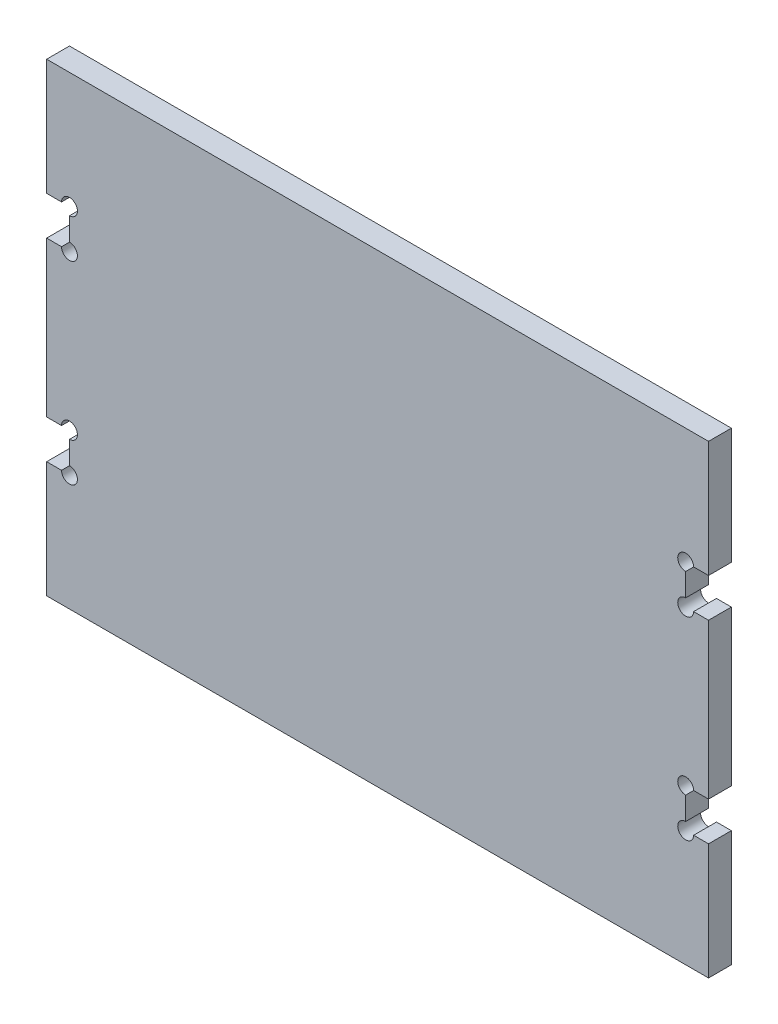
ISO-10303-21;
HEADER;
FILE_DESCRIPTION(('STEP AP214'),'2;1');
FILE_NAME('part.step','',(''),(''),'','','');
FILE_SCHEMA(('AUTOMOTIVE_DESIGN { 1 0 10303 214 1 1 1 1 }'));
ENDSEC;
DATA;
#1=APPLICATION_CONTEXT('core data for automotive mechanical design processes');
#2=APPLICATION_PROTOCOL_DEFINITION('international standard','automotive_design',2000,#1);
#3=PRODUCT_CONTEXT('',#1,'mechanical');
#4=PRODUCT('Part','Part','',(#3));
#5=PRODUCT_RELATED_PRODUCT_CATEGORY('part','',(#4));
#6=PRODUCT_DEFINITION_FORMATION('','',#4);
#7=PRODUCT_DEFINITION_CONTEXT('part definition',#1,'design');
#8=PRODUCT_DEFINITION('design','',#6,#7);
#9=PRODUCT_DEFINITION_SHAPE('','',#8);
#10=(LENGTH_UNIT() NAMED_UNIT(*) SI_UNIT(.MILLI.,.METRE.));
#11=(NAMED_UNIT(*) PLANE_ANGLE_UNIT() SI_UNIT($,.RADIAN.));
#12=(NAMED_UNIT(*) SI_UNIT($,.STERADIAN.) SOLID_ANGLE_UNIT());
#13=UNCERTAINTY_MEASURE_WITH_UNIT(LENGTH_MEASURE(1.E-05),#10,'distance_accuracy_value','');
#14=(GEOMETRIC_REPRESENTATION_CONTEXT(3) GLOBAL_UNCERTAINTY_ASSIGNED_CONTEXT((#13)) GLOBAL_UNIT_ASSIGNED_CONTEXT((#10,
#11,#12)) REPRESENTATION_CONTEXT('',''));
#15=CARTESIAN_POINT('',(0.,0.,0.));
#16=DIRECTION('',(0.,0.,1.));
#17=DIRECTION('',(1.,0.,0.));
#18=AXIS2_PLACEMENT_3D('',#15,#16,#17);
#19=CARTESIAN_POINT('',(-85.45,-60.,5.9));
#20=DIRECTION('',(1.,0.,0.));
#21=DIRECTION('',(0.,0.,-1.));
#22=AXIS2_PLACEMENT_3D('',#19,#20,#21);
#23=PLANE('',#22);
#24=DIRECTION('',(0.,-1.,0.));
#25=VECTOR('',#24,1.);
#26=CARTESIAN_POINT('',(-85.45,-60.,0.));
#27=LINE('',#26,#25);
#28=CARTESIAN_POINT('',(-85.45,60.,0.));
#29=VERTEX_POINT('',#28);
#30=CARTESIAN_POINT('',(-85.45,30.,0.));
#31=VERTEX_POINT('',#30);
#32=EDGE_CURVE('E347',#29,#31,#27,.T.);
#33=ORIENTED_EDGE('',*,*,#32,.T.);
#34=DIRECTION('',(0.,0.,1.));
#35=VECTOR('',#34,1.);
#36=CARTESIAN_POINT('',(-85.45,30.,0.));
#37=LINE('',#36,#35);
#38=CARTESIAN_POINT('',(-85.45,30.,5.9));
#39=VERTEX_POINT('',#38);
#40=EDGE_CURVE('E299',#31,#39,#37,.T.);
#41=ORIENTED_EDGE('',*,*,#40,.T.);
#42=DIRECTION('',(0.,-1.,0.));
#43=VECTOR('',#42,1.);
#44=CARTESIAN_POINT('',(-85.45,-60.,5.9));
#45=LINE('',#44,#43);
#46=CARTESIAN_POINT('',(-85.45,60.,5.9));
#47=VERTEX_POINT('',#46);
#48=EDGE_CURVE('E332',#47,#39,#45,.T.);
#49=ORIENTED_EDGE('',*,*,#48,.F.);
#50=DIRECTION('',(0.,0.,-1.));
#51=VECTOR('',#50,1.);
#52=CARTESIAN_POINT('',(-85.45,60.,5.9));
#53=LINE('',#52,#51);
#54=EDGE_CURVE('E346',#47,#29,#53,.T.);
#55=ORIENTED_EDGE('',*,*,#54,.T.);
#56=EDGE_LOOP('',(#33,#41,#49,#55));
#57=FACE_BOUND('',#56,.T.);
#58=ADVANCED_FACE('F39',(#57),#23,.F.);
#59=CARTESIAN_POINT('',(-85.45,20.,5.9));
#60=VERTEX_POINT('',#59);
#61=CARTESIAN_POINT('',(-85.45,-20.,5.9));
#62=VERTEX_POINT('',#61);
#63=EDGE_CURVE('E336',#60,#62,#45,.T.);
#64=ORIENTED_EDGE('',*,*,#63,.F.);
#65=DIRECTION('',(0.,0.,1.));
#66=VECTOR('',#65,1.);
#67=CARTESIAN_POINT('',(-85.45,20.,0.));
#68=LINE('',#67,#66);
#69=CARTESIAN_POINT('',(-85.45,20.,0.));
#70=VERTEX_POINT('',#69);
#71=EDGE_CURVE('E282',#70,#60,#68,.T.);
#72=ORIENTED_EDGE('',*,*,#71,.F.);
#73=CARTESIAN_POINT('',(-85.45,-20.,0.));
#74=VERTEX_POINT('',#73);
#75=EDGE_CURVE('E351',#70,#74,#27,.T.);
#76=ORIENTED_EDGE('',*,*,#75,.T.);
#77=DIRECTION('',(0.,0.,1.));
#78=VECTOR('',#77,1.);
#79=CARTESIAN_POINT('',(-85.45,-20.,0.));
#80=LINE('',#79,#78);
#81=EDGE_CURVE('E278',#74,#62,#80,.T.);
#82=ORIENTED_EDGE('',*,*,#81,.T.);
#83=EDGE_LOOP('',(#64,#72,#76,#82));
#84=FACE_BOUND('',#83,.T.);
#85=ADVANCED_FACE('F382',(#84),#23,.F.);
#86=CARTESIAN_POINT('',(85.45,-60.,5.9));
#87=DIRECTION('',(-1.,0.,0.));
#88=DIRECTION('',(0.,0.,1.));
#89=AXIS2_PLACEMENT_3D('',#86,#87,#88);
#90=PLANE('',#89);
#91=DIRECTION('',(0.,1.,0.));
#92=VECTOR('',#91,1.);
#93=CARTESIAN_POINT('',(85.45,-60.,0.));
#94=LINE('',#93,#92);
#95=CARTESIAN_POINT('',(85.45,-60.,0.));
#96=VERTEX_POINT('',#95);
#97=CARTESIAN_POINT('',(85.45,-30.,0.));
#98=VERTEX_POINT('',#97);
#99=EDGE_CURVE('E354',#96,#98,#94,.T.);
#100=ORIENTED_EDGE('',*,*,#99,.T.);
#101=DIRECTION('',(0.,0.,1.));
#102=VECTOR('',#101,1.);
#103=CARTESIAN_POINT('',(85.45,-30.,0.));
#104=LINE('',#103,#102);
#105=CARTESIAN_POINT('',(85.45,-30.,5.9));
#106=VERTEX_POINT('',#105);
#107=EDGE_CURVE('E249',#98,#106,#104,.T.);
#108=ORIENTED_EDGE('',*,*,#107,.T.);
#109=DIRECTION('',(0.,1.,0.));
#110=VECTOR('',#109,1.);
#111=CARTESIAN_POINT('',(85.45,-60.,5.9));
#112=LINE('',#111,#110);
#113=CARTESIAN_POINT('',(85.45,-60.,5.9));
#114=VERTEX_POINT('',#113);
#115=EDGE_CURVE('E340',#114,#106,#112,.T.);
#116=ORIENTED_EDGE('',*,*,#115,.F.);
#117=DIRECTION('',(0.,0.,-1.));
#118=VECTOR('',#117,1.);
#119=CARTESIAN_POINT('',(85.45,-60.,5.9));
#120=LINE('',#119,#118);
#121=EDGE_CURVE('E47',#114,#96,#120,.T.);
#122=ORIENTED_EDGE('',*,*,#121,.T.);
#123=EDGE_LOOP('',(#100,#108,#116,#122));
#124=FACE_BOUND('',#123,.T.);
#125=ADVANCED_FACE('F367',(#124),#90,.F.);
#126=CARTESIAN_POINT('',(85.45,-20.,5.9));
#127=VERTEX_POINT('',#126);
#128=CARTESIAN_POINT('',(85.45,20.,5.9));
#129=VERTEX_POINT('',#128);
#130=EDGE_CURVE('E344',#127,#129,#112,.T.);
#131=ORIENTED_EDGE('',*,*,#130,.F.);
#132=DIRECTION('',(0.,0.,1.));
#133=VECTOR('',#132,1.);
#134=CARTESIAN_POINT('',(85.45,-20.,0.));
#135=LINE('',#134,#133);
#136=CARTESIAN_POINT('',(85.45,-20.,0.));
#137=VERTEX_POINT('',#136);
#138=EDGE_CURVE('E251',#137,#127,#135,.T.);
#139=ORIENTED_EDGE('',*,*,#138,.F.);
#140=CARTESIAN_POINT('',(85.45,20.,0.));
#141=VERTEX_POINT('',#140);
#142=EDGE_CURVE('E357',#137,#141,#94,.T.);
#143=ORIENTED_EDGE('',*,*,#142,.T.);
#144=DIRECTION('',(0.,0.,1.));
#145=VECTOR('',#144,1.);
#146=CARTESIAN_POINT('',(85.45,20.,0.));
#147=LINE('',#146,#145);
#148=EDGE_CURVE('E327',#141,#129,#147,.T.);
#149=ORIENTED_EDGE('',*,*,#148,.T.);
#150=EDGE_LOOP('',(#131,#139,#143,#149));
#151=FACE_BOUND('',#150,.T.);
#152=ADVANCED_FACE('F446',(#151),#90,.F.);
#153=CARTESIAN_POINT('',(-85.45,-30.,5.9));
#154=VERTEX_POINT('',#153);
#155=CARTESIAN_POINT('',(-85.45,-60.,5.9));
#156=VERTEX_POINT('',#155);
#157=EDGE_CURVE('E337',#154,#156,#45,.T.);
#158=ORIENTED_EDGE('',*,*,#157,.F.);
#159=DIRECTION('',(0.,0.,1.));
#160=VECTOR('',#159,1.);
#161=CARTESIAN_POINT('',(-85.45,-30.,0.));
#162=LINE('',#161,#160);
#163=CARTESIAN_POINT('',(-85.45,-30.,0.));
#164=VERTEX_POINT('',#163);
#165=EDGE_CURVE('E262',#164,#154,#162,.T.);
#166=ORIENTED_EDGE('',*,*,#165,.F.);
#167=CARTESIAN_POINT('',(-85.45,-60.,0.));
#168=VERTEX_POINT('',#167);
#169=EDGE_CURVE('E330',#164,#168,#27,.T.);
#170=ORIENTED_EDGE('',*,*,#169,.T.);
#171=DIRECTION('',(0.,0.,-1.));
#172=VECTOR('',#171,1.);
#173=CARTESIAN_POINT('',(-85.45,-60.,5.9));
#174=LINE('',#173,#172);
#175=EDGE_CURVE('E11',#156,#168,#174,.T.);
#176=ORIENTED_EDGE('',*,*,#175,.F.);
#177=EDGE_LOOP('',(#158,#166,#170,#176));
#178=FACE_BOUND('',#177,.T.);
#179=ADVANCED_FACE('F41',(#178),#23,.F.);
#180=CARTESIAN_POINT('',(85.45,-60.,5.9));
#181=DIRECTION('',(0.,1.,0.));
#182=DIRECTION('',(-1.,0.,0.));
#183=AXIS2_PLACEMENT_3D('',#180,#181,#182);
#184=PLANE('',#183);
#185=DIRECTION('',(1.,0.,0.));
#186=VECTOR('',#185,1.);
#187=CARTESIAN_POINT('',(85.45,-60.,0.));
#188=LINE('',#187,#186);
#189=EDGE_CURVE('E350',#168,#96,#188,.T.);
#190=ORIENTED_EDGE('',*,*,#189,.T.);
#191=ORIENTED_EDGE('',*,*,#121,.F.);
#192=DIRECTION('',(1.,0.,0.));
#193=VECTOR('',#192,1.);
#194=CARTESIAN_POINT('',(85.45,-60.,5.9));
#195=LINE('',#194,#193);
#196=EDGE_CURVE('E335',#156,#114,#195,.T.);
#197=ORIENTED_EDGE('',*,*,#196,.F.);
#198=ORIENTED_EDGE('',*,*,#175,.T.);
#199=EDGE_LOOP('',(#190,#191,#197,#198));
#200=FACE_BOUND('',#199,.T.);
#201=ADVANCED_FACE('F373',(#200),#184,.F.);
#202=CARTESIAN_POINT('',(85.45,30.,5.9));
#203=VERTEX_POINT('',#202);
#204=CARTESIAN_POINT('',(85.45,60.,5.9));
#205=VERTEX_POINT('',#204);
#206=EDGE_CURVE('E339',#203,#205,#112,.T.);
#207=ORIENTED_EDGE('',*,*,#206,.F.);
#208=DIRECTION('',(0.,0.,1.));
#209=VECTOR('',#208,1.);
#210=CARTESIAN_POINT('',(85.45,30.,0.));
#211=LINE('',#210,#209);
#212=CARTESIAN_POINT('',(85.45,30.,0.));
#213=VERTEX_POINT('',#212);
#214=EDGE_CURVE('E320',#213,#203,#211,.T.);
#215=ORIENTED_EDGE('',*,*,#214,.F.);
#216=CARTESIAN_POINT('',(85.45,60.,0.));
#217=VERTEX_POINT('',#216);
#218=EDGE_CURVE('E353',#213,#217,#94,.T.);
#219=ORIENTED_EDGE('',*,*,#218,.T.);
#220=DIRECTION('',(0.,0.,-1.));
#221=VECTOR('',#220,1.);
#222=CARTESIAN_POINT('',(85.45,60.,5.9));
#223=LINE('',#222,#221);
#224=EDGE_CURVE('E361',#205,#217,#223,.T.);
#225=ORIENTED_EDGE('',*,*,#224,.F.);
#226=EDGE_LOOP('',(#207,#215,#219,#225));
#227=FACE_BOUND('',#226,.T.);
#228=ADVANCED_FACE('F458',(#227),#90,.F.);
#229=CARTESIAN_POINT('',(85.45,60.,5.9));
#230=DIRECTION('',(0.,-1.,0.));
#231=DIRECTION('',(1.,0.,0.));
#232=AXIS2_PLACEMENT_3D('',#229,#230,#231);
#233=PLANE('',#232);
#234=DIRECTION('',(-1.,0.,0.));
#235=VECTOR('',#234,1.);
#236=CARTESIAN_POINT('',(85.45,60.,0.));
#237=LINE('',#236,#235);
#238=EDGE_CURVE('E356',#217,#29,#237,.T.);
#239=ORIENTED_EDGE('',*,*,#238,.T.);
#240=ORIENTED_EDGE('',*,*,#54,.F.);
#241=DIRECTION('',(-1.,0.,0.));
#242=VECTOR('',#241,1.);
#243=CARTESIAN_POINT('',(85.45,60.,5.9));
#244=LINE('',#243,#242);
#245=EDGE_CURVE('E343',#205,#47,#244,.T.);
#246=ORIENTED_EDGE('',*,*,#245,.F.);
#247=ORIENTED_EDGE('',*,*,#224,.T.);
#248=EDGE_LOOP('',(#239,#240,#246,#247));
#249=FACE_BOUND('',#248,.T.);
#250=ADVANCED_FACE('F462',(#249),#233,.F.);
#251=CARTESIAN_POINT('',(0.,0.,5.9));
#252=DIRECTION('',(0.,0.,1.));
#253=DIRECTION('',(1.,0.,0.));
#254=AXIS2_PLACEMENT_3D('',#251,#252,#253);
#255=PLANE('',#254);
#256=CARTESIAN_POINT('',(79.55,-20.,5.9));
#257=DIRECTION('',(0.,0.,1.));
#258=DIRECTION('',(1.,0.,0.));
#259=AXIS2_PLACEMENT_3D('',#256,#257,#258);
#260=CIRCLE('',#259,2.04999999999999);
#261=CARTESIAN_POINT('',(81.6,-20.,5.9));
#262=VERTEX_POINT('',#261);
#263=CARTESIAN_POINT('',(79.55,-22.05,5.9));
#264=VERTEX_POINT('',#263);
#265=EDGE_CURVE('E823',#262,#264,#260,.T.);
#266=ORIENTED_EDGE('',*,*,#265,.F.);
#267=DIRECTION('',(-1.,0.,0.));
#268=VECTOR('',#267,1.);
#269=CARTESIAN_POINT('',(85.45,-20.,5.9));
#270=LINE('',#269,#268);
#271=EDGE_CURVE('E258',#127,#262,#270,.T.);
#272=ORIENTED_EDGE('',*,*,#271,.F.);
#273=ORIENTED_EDGE('',*,*,#130,.T.);
#274=DIRECTION('',(1.,0.,0.));
#275=VECTOR('',#274,1.);
#276=CARTESIAN_POINT('',(85.45,20.,5.9));
#277=LINE('',#276,#275);
#278=CARTESIAN_POINT('',(81.6,20.,5.9));
#279=VERTEX_POINT('',#278);
#280=EDGE_CURVE('E315',#279,#129,#277,.T.);
#281=ORIENTED_EDGE('',*,*,#280,.F.);
#282=CARTESIAN_POINT('',(79.55,20.,5.9));
#283=DIRECTION('',(0.,0.,1.));
#284=DIRECTION('',(1.,0.,0.));
#285=AXIS2_PLACEMENT_3D('',#282,#283,#284);
#286=CIRCLE('',#285,2.04999999999999);
#287=CARTESIAN_POINT('',(79.55,22.05,5.9));
#288=VERTEX_POINT('',#287);
#289=EDGE_CURVE('E803',#288,#279,#286,.T.);
#290=ORIENTED_EDGE('',*,*,#289,.F.);
#291=DIRECTION('',(0.,-1.,0.));
#292=VECTOR('',#291,1.);
#293=CARTESIAN_POINT('',(79.55,30.,5.9));
#294=LINE('',#293,#292);
#295=CARTESIAN_POINT('',(79.55,27.95,5.9));
#296=VERTEX_POINT('',#295);
#297=EDGE_CURVE('E323',#296,#288,#294,.T.);
#298=ORIENTED_EDGE('',*,*,#297,.F.);
#299=CARTESIAN_POINT('',(79.55,30.,5.9));
#300=DIRECTION('',(0.,0.,1.));
#301=DIRECTION('',(1.,0.,0.));
#302=AXIS2_PLACEMENT_3D('',#299,#300,#301);
#303=CIRCLE('',#302,2.04999999999999);
#304=CARTESIAN_POINT('',(81.6,30.,5.9));
#305=VERTEX_POINT('',#304);
#306=EDGE_CURVE('E813',#305,#296,#303,.T.);
#307=ORIENTED_EDGE('',*,*,#306,.F.);
#308=DIRECTION('',(-1.,0.,0.));
#309=VECTOR('',#308,1.);
#310=CARTESIAN_POINT('',(85.45,30.,5.9));
#311=LINE('',#310,#309);
#312=EDGE_CURVE('E267',#203,#305,#311,.T.);
#313=ORIENTED_EDGE('',*,*,#312,.F.);
#314=ORIENTED_EDGE('',*,*,#206,.T.);
#315=ORIENTED_EDGE('',*,*,#245,.T.);
#316=ORIENTED_EDGE('',*,*,#48,.T.);
#317=DIRECTION('',(-1.,0.,0.));
#318=VECTOR('',#317,1.);
#319=CARTESIAN_POINT('',(-85.45,30.,5.9));
#320=LINE('',#319,#318);
#321=CARTESIAN_POINT('',(-81.6,30.,5.9));
#322=VERTEX_POINT('',#321);
#323=EDGE_CURVE('E300',#322,#39,#320,.T.);
#324=ORIENTED_EDGE('',*,*,#323,.F.);
#325=CARTESIAN_POINT('',(-79.55,30.,5.9));
#326=DIRECTION('',(0.,0.,1.));
#327=DIRECTION('',(1.,0.,0.));
#328=AXIS2_PLACEMENT_3D('',#325,#326,#327);
#329=CIRCLE('',#328,2.04999999999999);
#330=CARTESIAN_POINT('',(-79.55,27.95,5.9));
#331=VERTEX_POINT('',#330);
#332=EDGE_CURVE('E434',#331,#322,#329,.T.);
#333=ORIENTED_EDGE('',*,*,#332,.F.);
#334=DIRECTION('',(0.,1.,0.));
#335=VECTOR('',#334,1.);
#336=CARTESIAN_POINT('',(-79.55,30.,5.9));
#337=LINE('',#336,#335);
#338=CARTESIAN_POINT('',(-79.55,22.05,5.9));
#339=VERTEX_POINT('',#338);
#340=EDGE_CURVE('E293',#339,#331,#337,.T.);
#341=ORIENTED_EDGE('',*,*,#340,.F.);
#342=CARTESIAN_POINT('',(-79.55,20.,5.9));
#343=DIRECTION('',(0.,0.,1.));
#344=DIRECTION('',(1.,0.,0.));
#345=AXIS2_PLACEMENT_3D('',#342,#343,#344);
#346=CIRCLE('',#345,2.04999999999999);
#347=CARTESIAN_POINT('',(-81.6,20.,5.9));
#348=VERTEX_POINT('',#347);
#349=EDGE_CURVE('E424',#348,#339,#346,.T.);
#350=ORIENTED_EDGE('',*,*,#349,.F.);
#351=DIRECTION('',(1.,0.,0.));
#352=VECTOR('',#351,1.);
#353=CARTESIAN_POINT('',(-85.45,20.,5.9));
#354=LINE('',#353,#352);
#355=EDGE_CURVE('E302',#60,#348,#354,.T.);
#356=ORIENTED_EDGE('',*,*,#355,.F.);
#357=ORIENTED_EDGE('',*,*,#63,.T.);
#358=DIRECTION('',(-1.,0.,0.));
#359=VECTOR('',#358,1.);
#360=CARTESIAN_POINT('',(-85.45,-20.,5.9));
#361=LINE('',#360,#359);
#362=CARTESIAN_POINT('',(-81.6,-20.,5.9));
#363=VERTEX_POINT('',#362);
#364=EDGE_CURVE('E279',#363,#62,#361,.T.);
#365=ORIENTED_EDGE('',*,*,#364,.F.);
#366=CARTESIAN_POINT('',(-79.55,-20.,5.9));
#367=DIRECTION('',(0.,0.,1.));
#368=DIRECTION('',(1.,0.,0.));
#369=AXIS2_PLACEMENT_3D('',#366,#367,#368);
#370=CIRCLE('',#369,2.04999999999999);
#371=CARTESIAN_POINT('',(-79.55,-22.05,5.9));
#372=VERTEX_POINT('',#371);
#373=EDGE_CURVE('E399',#372,#363,#370,.T.);
#374=ORIENTED_EDGE('',*,*,#373,.F.);
#375=DIRECTION('',(0.,1.,0.));
#376=VECTOR('',#375,1.);
#377=CARTESIAN_POINT('',(-79.55,-20.,5.9));
#378=LINE('',#377,#376);
#379=CARTESIAN_POINT('',(-79.55,-27.95,5.9));
#380=VERTEX_POINT('',#379);
#381=EDGE_CURVE('E272',#380,#372,#378,.T.);
#382=ORIENTED_EDGE('',*,*,#381,.F.);
#383=CARTESIAN_POINT('',(-79.55,-30.,5.9));
#384=DIRECTION('',(0.,0.,1.));
#385=DIRECTION('',(1.,0.,0.));
#386=AXIS2_PLACEMENT_3D('',#383,#384,#385);
#387=CIRCLE('',#386,2.04999999999999);
#388=CARTESIAN_POINT('',(-81.6,-30.,5.9));
#389=VERTEX_POINT('',#388);
#390=EDGE_CURVE('E404',#389,#380,#387,.T.);
#391=ORIENTED_EDGE('',*,*,#390,.F.);
#392=DIRECTION('',(1.,0.,0.));
#393=VECTOR('',#392,1.);
#394=CARTESIAN_POINT('',(-85.45,-30.,5.9));
#395=LINE('',#394,#393);
#396=EDGE_CURVE('E281',#154,#389,#395,.T.);
#397=ORIENTED_EDGE('',*,*,#396,.F.);
#398=ORIENTED_EDGE('',*,*,#157,.T.);
#399=ORIENTED_EDGE('',*,*,#196,.T.);
#400=ORIENTED_EDGE('',*,*,#115,.T.);
#401=DIRECTION('',(1.,0.,0.));
#402=VECTOR('',#401,1.);
#403=CARTESIAN_POINT('',(85.45,-30.,5.9));
#404=LINE('',#403,#402);
#405=CARTESIAN_POINT('',(81.6,-30.,5.9));
#406=VERTEX_POINT('',#405);
#407=EDGE_CURVE('E265',#406,#106,#404,.T.);
#408=ORIENTED_EDGE('',*,*,#407,.F.);
#409=CARTESIAN_POINT('',(79.55,-30.,5.9));
#410=DIRECTION('',(0.,0.,1.));
#411=DIRECTION('',(1.,0.,0.));
#412=AXIS2_PLACEMENT_3D('',#409,#410,#411);
#413=CIRCLE('',#412,2.04999999999999);
#414=CARTESIAN_POINT('',(79.55,-27.95,5.9));
#415=VERTEX_POINT('',#414);
#416=EDGE_CURVE('E229',#415,#406,#413,.T.);
#417=ORIENTED_EDGE('',*,*,#416,.F.);
#418=DIRECTION('',(0.,-1.,0.));
#419=VECTOR('',#418,1.);
#420=CARTESIAN_POINT('',(79.55,-20.,5.9));
#421=LINE('',#420,#419);
#422=EDGE_CURVE('E261',#264,#415,#421,.T.);
#423=ORIENTED_EDGE('',*,*,#422,.F.);
#424=EDGE_LOOP('',(#266,#272,#273,#281,#290,#298,#307,#313,#314,#315,#316,#324,#333,#341,#350,
#356,#357,#365,#374,#382,#391,#397,#398,#399,#400,#408,#417,#423));
#425=FACE_BOUND('',#424,.T.);
#426=ADVANCED_FACE('F397',(#425),#255,.T.);
#427=CARTESIAN_POINT('',(0.,0.,0.));
#428=DIRECTION('',(0.,0.,1.));
#429=DIRECTION('',(1.,0.,0.));
#430=AXIS2_PLACEMENT_3D('',#427,#428,#429);
#431=PLANE('',#430);
#432=DIRECTION('',(-1.,0.,0.));
#433=VECTOR('',#432,1.);
#434=CARTESIAN_POINT('',(85.45,-20.,0.));
#435=LINE('',#434,#433);
#436=CARTESIAN_POINT('',(81.6,-20.,0.));
#437=VERTEX_POINT('',#436);
#438=EDGE_CURVE('E254',#137,#437,#435,.T.);
#439=ORIENTED_EDGE('',*,*,#438,.T.);
#440=CARTESIAN_POINT('',(79.55,-20.,0.));
#441=DIRECTION('',(0.,0.,1.));
#442=DIRECTION('',(1.,0.,0.));
#443=AXIS2_PLACEMENT_3D('',#440,#441,#442);
#444=CIRCLE('',#443,2.04999999999999);
#445=CARTESIAN_POINT('',(79.55,-22.05,0.));
#446=VERTEX_POINT('',#445);
#447=EDGE_CURVE('E437',#446,#437,#444,.F.);
#448=ORIENTED_EDGE('',*,*,#447,.F.);
#449=DIRECTION('',(0.,-1.,0.));
#450=VECTOR('',#449,1.);
#451=CARTESIAN_POINT('',(79.55,-20.,0.));
#452=LINE('',#451,#450);
#453=CARTESIAN_POINT('',(79.55,-27.95,0.));
#454=VERTEX_POINT('',#453);
#455=EDGE_CURVE('E244',#446,#454,#452,.T.);
#456=ORIENTED_EDGE('',*,*,#455,.T.);
#457=CARTESIAN_POINT('',(79.55,-30.,0.));
#458=DIRECTION('',(0.,0.,1.));
#459=DIRECTION('',(1.,0.,0.));
#460=AXIS2_PLACEMENT_3D('',#457,#458,#459);
#461=CIRCLE('',#460,2.04999999999999);
#462=CARTESIAN_POINT('',(81.6,-30.,0.));
#463=VERTEX_POINT('',#462);
#464=EDGE_CURVE('E226',#463,#454,#461,.F.);
#465=ORIENTED_EDGE('',*,*,#464,.F.);
#466=DIRECTION('',(1.,0.,0.));
#467=VECTOR('',#466,1.);
#468=CARTESIAN_POINT('',(85.45,-30.,0.));
#469=LINE('',#468,#467);
#470=EDGE_CURVE('E240',#463,#98,#469,.T.);
#471=ORIENTED_EDGE('',*,*,#470,.T.);
#472=ORIENTED_EDGE('',*,*,#99,.F.);
#473=ORIENTED_EDGE('',*,*,#189,.F.);
#474=ORIENTED_EDGE('',*,*,#169,.F.);
#475=DIRECTION('',(1.,0.,0.));
#476=VECTOR('',#475,1.);
#477=CARTESIAN_POINT('',(-85.45,-30.,0.));
#478=LINE('',#477,#476);
#479=CARTESIAN_POINT('',(-81.6,-30.,0.));
#480=VERTEX_POINT('',#479);
#481=EDGE_CURVE('E271',#164,#480,#478,.T.);
#482=ORIENTED_EDGE('',*,*,#481,.T.);
#483=CARTESIAN_POINT('',(-79.55,-30.,0.));
#484=DIRECTION('',(0.,0.,1.));
#485=DIRECTION('',(1.,0.,0.));
#486=AXIS2_PLACEMENT_3D('',#483,#484,#485);
#487=CIRCLE('',#486,2.04999999999999);
#488=CARTESIAN_POINT('',(-79.55,-27.95,0.));
#489=VERTEX_POINT('',#488);
#490=EDGE_CURVE('E410',#489,#480,#487,.F.);
#491=ORIENTED_EDGE('',*,*,#490,.F.);
#492=DIRECTION('',(0.,1.,0.));
#493=VECTOR('',#492,1.);
#494=CARTESIAN_POINT('',(-79.55,-20.,0.));
#495=LINE('',#494,#493);
#496=CARTESIAN_POINT('',(-79.55,-22.05,0.));
#497=VERTEX_POINT('',#496);
#498=EDGE_CURVE('E275',#489,#497,#495,.T.);
#499=ORIENTED_EDGE('',*,*,#498,.T.);
#500=CARTESIAN_POINT('',(-79.55,-20.,0.));
#501=DIRECTION('',(0.,0.,1.));
#502=DIRECTION('',(1.,0.,0.));
#503=AXIS2_PLACEMENT_3D('',#500,#501,#502);
#504=CIRCLE('',#503,2.04999999999999);
#505=CARTESIAN_POINT('',(-81.6,-20.,0.));
#506=VERTEX_POINT('',#505);
#507=EDGE_CURVE('E388',#506,#497,#504,.F.);
#508=ORIENTED_EDGE('',*,*,#507,.F.);
#509=DIRECTION('',(-1.,0.,0.));
#510=VECTOR('',#509,1.);
#511=CARTESIAN_POINT('',(-85.45,-20.,0.));
#512=LINE('',#511,#510);
#513=EDGE_CURVE('E269',#506,#74,#512,.T.);
#514=ORIENTED_EDGE('',*,*,#513,.T.);
#515=ORIENTED_EDGE('',*,*,#75,.F.);
#516=DIRECTION('',(1.,0.,0.));
#517=VECTOR('',#516,1.);
#518=CARTESIAN_POINT('',(-85.45,20.,0.));
#519=LINE('',#518,#517);
#520=CARTESIAN_POINT('',(-81.6,20.,0.));
#521=VERTEX_POINT('',#520);
#522=EDGE_CURVE('E292',#70,#521,#519,.T.);
#523=ORIENTED_EDGE('',*,*,#522,.T.);
#524=CARTESIAN_POINT('',(-79.55,20.,0.));
#525=DIRECTION('',(0.,0.,1.));
#526=DIRECTION('',(1.,0.,0.));
#527=AXIS2_PLACEMENT_3D('',#524,#525,#526);
#528=CIRCLE('',#527,2.04999999999999);
#529=CARTESIAN_POINT('',(-79.55,22.05,0.));
#530=VERTEX_POINT('',#529);
#531=EDGE_CURVE('E422',#530,#521,#528,.F.);
#532=ORIENTED_EDGE('',*,*,#531,.F.);
#533=DIRECTION('',(0.,1.,0.));
#534=VECTOR('',#533,1.);
#535=CARTESIAN_POINT('',(-79.55,30.,0.));
#536=LINE('',#535,#534);
#537=CARTESIAN_POINT('',(-79.55,27.95,0.));
#538=VERTEX_POINT('',#537);
#539=EDGE_CURVE('E296',#530,#538,#536,.T.);
#540=ORIENTED_EDGE('',*,*,#539,.T.);
#541=CARTESIAN_POINT('',(-79.55,30.,0.));
#542=DIRECTION('',(0.,0.,1.));
#543=DIRECTION('',(1.,0.,0.));
#544=AXIS2_PLACEMENT_3D('',#541,#542,#543);
#545=CIRCLE('',#544,2.04999999999999);
#546=CARTESIAN_POINT('',(-81.6,30.,0.));
#547=VERTEX_POINT('',#546);
#548=EDGE_CURVE('E303',#547,#538,#545,.F.);
#549=ORIENTED_EDGE('',*,*,#548,.F.);
#550=DIRECTION('',(-1.,0.,0.));
#551=VECTOR('',#550,1.);
#552=CARTESIAN_POINT('',(-85.45,30.,0.));
#553=LINE('',#552,#551);
#554=EDGE_CURVE('E290',#547,#31,#553,.T.);
#555=ORIENTED_EDGE('',*,*,#554,.T.);
#556=ORIENTED_EDGE('',*,*,#32,.F.);
#557=ORIENTED_EDGE('',*,*,#238,.F.);
#558=ORIENTED_EDGE('',*,*,#218,.F.);
#559=DIRECTION('',(-1.,0.,0.));
#560=VECTOR('',#559,1.);
#561=CARTESIAN_POINT('',(85.45,30.,0.));
#562=LINE('',#561,#560);
#563=CARTESIAN_POINT('',(81.6,30.,0.));
#564=VERTEX_POINT('',#563);
#565=EDGE_CURVE('E311',#213,#564,#562,.T.);
#566=ORIENTED_EDGE('',*,*,#565,.T.);
#567=CARTESIAN_POINT('',(79.55,30.,0.));
#568=DIRECTION('',(0.,0.,1.));
#569=DIRECTION('',(1.,0.,0.));
#570=AXIS2_PLACEMENT_3D('',#567,#568,#569);
#571=CIRCLE('',#570,2.04999999999999);
#572=CARTESIAN_POINT('',(79.55,27.95,0.));
#573=VERTEX_POINT('',#572);
#574=EDGE_CURVE('E62',#573,#564,#571,.F.);
#575=ORIENTED_EDGE('',*,*,#574,.F.);
#576=DIRECTION('',(0.,-1.,0.));
#577=VECTOR('',#576,1.);
#578=CARTESIAN_POINT('',(79.55,30.,0.));
#579=LINE('',#578,#577);
#580=CARTESIAN_POINT('',(79.55,22.05,0.));
#581=VERTEX_POINT('',#580);
#582=EDGE_CURVE('E314',#573,#581,#579,.T.);
#583=ORIENTED_EDGE('',*,*,#582,.T.);
#584=CARTESIAN_POINT('',(79.55,20.,0.));
#585=DIRECTION('',(0.,0.,1.));
#586=DIRECTION('',(1.,0.,0.));
#587=AXIS2_PLACEMENT_3D('',#584,#585,#586);
#588=CIRCLE('',#587,2.04999999999999);
#589=CARTESIAN_POINT('',(81.6,20.,0.));
#590=VERTEX_POINT('',#589);
#591=EDGE_CURVE('E54',#590,#581,#588,.F.);
#592=ORIENTED_EDGE('',*,*,#591,.F.);
#593=DIRECTION('',(1.,0.,0.));
#594=VECTOR('',#593,1.);
#595=CARTESIAN_POINT('',(85.45,20.,0.));
#596=LINE('',#595,#594);
#597=EDGE_CURVE('E318',#590,#141,#596,.T.);
#598=ORIENTED_EDGE('',*,*,#597,.T.);
#599=ORIENTED_EDGE('',*,*,#142,.F.);
#600=EDGE_LOOP('',(#439,#448,#456,#465,#471,#472,#473,#474,#482,#491,#499,#508,#514,#515,#523,
#532,#540,#549,#555,#556,#557,#558,#566,#575,#583,#592,#598,#599));
#601=FACE_BOUND('',#600,.T.);
#602=ADVANCED_FACE('F238',(#601),#431,.F.);
#603=CARTESIAN_POINT('',(85.45,20.,0.));
#604=DIRECTION('',(0.,-1.,0.));
#605=DIRECTION('',(0.,0.,-1.));
#606=AXIS2_PLACEMENT_3D('',#603,#604,#605);
#607=PLANE('',#606);
#608=ORIENTED_EDGE('',*,*,#597,.F.);
#609=DIRECTION('',(0.,0.,1.));
#610=VECTOR('',#609,1.);
#611=CARTESIAN_POINT('',(81.6,20.,-0.00100000000000013));
#612=LINE('',#611,#610);
#613=EDGE_CURVE('E801',#279,#590,#612,.F.);
#614=ORIENTED_EDGE('',*,*,#613,.F.);
#615=ORIENTED_EDGE('',*,*,#280,.T.);
#616=ORIENTED_EDGE('',*,*,#148,.F.);
#617=EDGE_LOOP('',(#608,#614,#615,#616));
#618=FACE_BOUND('',#617,.T.);
#619=ADVANCED_FACE('F529',(#618),#607,.F.);
#620=CARTESIAN_POINT('',(79.55,30.,0.));
#621=DIRECTION('',(-1.,0.,0.));
#622=DIRECTION('',(0.,-1.,0.));
#623=AXIS2_PLACEMENT_3D('',#620,#621,#622);
#624=PLANE('',#623);
#625=ORIENTED_EDGE('',*,*,#297,.T.);
#626=DIRECTION('',(0.,0.,1.));
#627=VECTOR('',#626,1.);
#628=CARTESIAN_POINT('',(79.55,22.05,-0.00100000000000013));
#629=LINE('',#628,#627);
#630=EDGE_CURVE('E245',#581,#288,#629,.T.);
#631=ORIENTED_EDGE('',*,*,#630,.F.);
#632=ORIENTED_EDGE('',*,*,#582,.F.);
#633=DIRECTION('',(0.,0.,1.));
#634=VECTOR('',#633,1.);
#635=CARTESIAN_POINT('',(79.55,27.95,-0.00100000000000013));
#636=LINE('',#635,#634);
#637=EDGE_CURVE('E812',#296,#573,#636,.F.);
#638=ORIENTED_EDGE('',*,*,#637,.F.);
#639=EDGE_LOOP('',(#625,#631,#632,#638));
#640=FACE_BOUND('',#639,.T.);
#641=ADVANCED_FACE('F534',(#640),#624,.F.);
#642=CARTESIAN_POINT('',(85.45,30.,0.));
#643=DIRECTION('',(0.,1.,0.));
#644=DIRECTION('',(0.,0.,1.));
#645=AXIS2_PLACEMENT_3D('',#642,#643,#644);
#646=PLANE('',#645);
#647=ORIENTED_EDGE('',*,*,#312,.T.);
#648=DIRECTION('',(0.,0.,1.));
#649=VECTOR('',#648,1.);
#650=CARTESIAN_POINT('',(81.6,30.,-0.00100000000000013));
#651=LINE('',#650,#649);
#652=EDGE_CURVE('E807',#564,#305,#651,.T.);
#653=ORIENTED_EDGE('',*,*,#652,.F.);
#654=ORIENTED_EDGE('',*,*,#565,.F.);
#655=ORIENTED_EDGE('',*,*,#214,.T.);
#656=EDGE_LOOP('',(#647,#653,#654,#655));
#657=FACE_BOUND('',#656,.T.);
#658=ADVANCED_FACE('F531',(#657),#646,.F.);
#659=CARTESIAN_POINT('',(85.45,-30.,0.));
#660=DIRECTION('',(0.,-1.,0.));
#661=DIRECTION('',(0.,0.,-1.));
#662=AXIS2_PLACEMENT_3D('',#659,#660,#661);
#663=PLANE('',#662);
#664=ORIENTED_EDGE('',*,*,#470,.F.);
#665=DIRECTION('',(0.,0.,1.));
#666=VECTOR('',#665,1.);
#667=CARTESIAN_POINT('',(81.6,-30.,-0.00100000000000013));
#668=LINE('',#667,#666);
#669=EDGE_CURVE('E223',#406,#463,#668,.F.);
#670=ORIENTED_EDGE('',*,*,#669,.F.);
#671=ORIENTED_EDGE('',*,*,#407,.T.);
#672=ORIENTED_EDGE('',*,*,#107,.F.);
#673=EDGE_LOOP('',(#664,#670,#671,#672));
#674=FACE_BOUND('',#673,.T.);
#675=ADVANCED_FACE('F247',(#674),#663,.F.);
#676=CARTESIAN_POINT('',(79.55,-20.,0.));
#677=DIRECTION('',(-1.,0.,0.));
#678=DIRECTION('',(0.,0.,1.));
#679=AXIS2_PLACEMENT_3D('',#676,#677,#678);
#680=PLANE('',#679);
#681=ORIENTED_EDGE('',*,*,#455,.F.);
#682=DIRECTION('',(0.,0.,1.));
#683=VECTOR('',#682,1.);
#684=CARTESIAN_POINT('',(79.55,-22.05,-0.00100000000000013));
#685=LINE('',#684,#683);
#686=EDGE_CURVE('E825',#264,#446,#685,.F.);
#687=ORIENTED_EDGE('',*,*,#686,.F.);
#688=ORIENTED_EDGE('',*,*,#422,.T.);
#689=DIRECTION('',(0.,0.,1.));
#690=VECTOR('',#689,1.);
#691=CARTESIAN_POINT('',(79.55,-27.95,-0.00100000000000013));
#692=LINE('',#691,#690);
#693=EDGE_CURVE('E233',#454,#415,#692,.T.);
#694=ORIENTED_EDGE('',*,*,#693,.F.);
#695=EDGE_LOOP('',(#681,#687,#688,#694));
#696=FACE_BOUND('',#695,.T.);
#697=ADVANCED_FACE('F557',(#696),#680,.F.);
#698=CARTESIAN_POINT('',(85.45,-20.,0.));
#699=DIRECTION('',(0.,1.,0.));
#700=DIRECTION('',(0.,0.,1.));
#701=AXIS2_PLACEMENT_3D('',#698,#699,#700);
#702=PLANE('',#701);
#703=ORIENTED_EDGE('',*,*,#271,.T.);
#704=DIRECTION('',(0.,0.,1.));
#705=VECTOR('',#704,1.);
#706=CARTESIAN_POINT('',(81.6,-20.,-0.00100000000000013));
#707=LINE('',#706,#705);
#708=EDGE_CURVE('E413',#437,#262,#707,.T.);
#709=ORIENTED_EDGE('',*,*,#708,.F.);
#710=ORIENTED_EDGE('',*,*,#438,.F.);
#711=ORIENTED_EDGE('',*,*,#138,.T.);
#712=EDGE_LOOP('',(#703,#709,#710,#711));
#713=FACE_BOUND('',#712,.T.);
#714=ADVANCED_FACE('F442',(#713),#702,.F.);
#715=CARTESIAN_POINT('',(-85.45,-20.,0.));
#716=DIRECTION('',(0.,1.,0.));
#717=DIRECTION('',(0.,0.,1.));
#718=AXIS2_PLACEMENT_3D('',#715,#716,#717);
#719=PLANE('',#718);
#720=ORIENTED_EDGE('',*,*,#513,.F.);
#721=DIRECTION('',(0.,0.,1.));
#722=VECTOR('',#721,1.);
#723=CARTESIAN_POINT('',(-81.6,-20.,-0.00100000000000013));
#724=LINE('',#723,#722);
#725=EDGE_CURVE('E393',#363,#506,#724,.F.);
#726=ORIENTED_EDGE('',*,*,#725,.F.);
#727=ORIENTED_EDGE('',*,*,#364,.T.);
#728=ORIENTED_EDGE('',*,*,#81,.F.);
#729=EDGE_LOOP('',(#720,#726,#727,#728));
#730=FACE_BOUND('',#729,.T.);
#731=ADVANCED_FACE('F391',(#730),#719,.F.);
#732=CARTESIAN_POINT('',(-79.55,-20.,0.));
#733=DIRECTION('',(1.,0.,0.));
#734=DIRECTION('',(0.,0.,-1.));
#735=AXIS2_PLACEMENT_3D('',#732,#733,#734);
#736=PLANE('',#735);
#737=ORIENTED_EDGE('',*,*,#498,.F.);
#738=DIRECTION('',(0.,0.,1.));
#739=VECTOR('',#738,1.);
#740=CARTESIAN_POINT('',(-79.55,-27.95,-0.00100000000000013));
#741=LINE('',#740,#739);
#742=EDGE_CURVE('E419',#380,#489,#741,.F.);
#743=ORIENTED_EDGE('',*,*,#742,.F.);
#744=ORIENTED_EDGE('',*,*,#381,.T.);
#745=DIRECTION('',(0.,0.,1.));
#746=VECTOR('',#745,1.);
#747=CARTESIAN_POINT('',(-79.55,-22.05,-0.00100000000000013));
#748=LINE('',#747,#746);
#749=EDGE_CURVE('E420',#497,#372,#748,.T.);
#750=ORIENTED_EDGE('',*,*,#749,.F.);
#751=EDGE_LOOP('',(#737,#743,#744,#750));
#752=FACE_BOUND('',#751,.T.);
#753=ADVANCED_FACE('F418',(#752),#736,.F.);
#754=CARTESIAN_POINT('',(-85.45,-30.,0.));
#755=DIRECTION('',(0.,-1.,0.));
#756=DIRECTION('',(0.,0.,-1.));
#757=AXIS2_PLACEMENT_3D('',#754,#755,#756);
#758=PLANE('',#757);
#759=ORIENTED_EDGE('',*,*,#396,.T.);
#760=DIRECTION('',(0.,0.,1.));
#761=VECTOR('',#760,1.);
#762=CARTESIAN_POINT('',(-81.6,-30.,-0.00100000000000013));
#763=LINE('',#762,#761);
#764=EDGE_CURVE('E408',#480,#389,#763,.T.);
#765=ORIENTED_EDGE('',*,*,#764,.F.);
#766=ORIENTED_EDGE('',*,*,#481,.F.);
#767=ORIENTED_EDGE('',*,*,#165,.T.);
#768=EDGE_LOOP('',(#759,#765,#766,#767));
#769=FACE_BOUND('',#768,.T.);
#770=ADVANCED_FACE('F407',(#769),#758,.F.);
#771=CARTESIAN_POINT('',(-85.45,30.,0.));
#772=DIRECTION('',(0.,1.,0.));
#773=DIRECTION('',(0.,0.,1.));
#774=AXIS2_PLACEMENT_3D('',#771,#772,#773);
#775=PLANE('',#774);
#776=ORIENTED_EDGE('',*,*,#554,.F.);
#777=DIRECTION('',(0.,0.,1.));
#778=VECTOR('',#777,1.);
#779=CARTESIAN_POINT('',(-81.6,30.,-0.00100000000000013));
#780=LINE('',#779,#778);
#781=EDGE_CURVE('E431',#322,#547,#780,.F.);
#782=ORIENTED_EDGE('',*,*,#781,.F.);
#783=ORIENTED_EDGE('',*,*,#323,.T.);
#784=ORIENTED_EDGE('',*,*,#40,.F.);
#785=EDGE_LOOP('',(#776,#782,#783,#784));
#786=FACE_BOUND('',#785,.T.);
#787=ADVANCED_FACE('F473',(#786),#775,.F.);
#788=CARTESIAN_POINT('',(-79.55,30.,0.));
#789=DIRECTION('',(1.,0.,0.));
#790=DIRECTION('',(0.,1.,0.));
#791=AXIS2_PLACEMENT_3D('',#788,#789,#790);
#792=PLANE('',#791);
#793=ORIENTED_EDGE('',*,*,#539,.F.);
#794=DIRECTION('',(0.,0.,1.));
#795=VECTOR('',#794,1.);
#796=CARTESIAN_POINT('',(-79.55,22.05,-0.00100000000000013));
#797=LINE('',#796,#795);
#798=EDGE_CURVE('E482',#339,#530,#797,.F.);
#799=ORIENTED_EDGE('',*,*,#798,.F.);
#800=ORIENTED_EDGE('',*,*,#340,.T.);
#801=DIRECTION('',(0.,0.,1.));
#802=VECTOR('',#801,1.);
#803=CARTESIAN_POINT('',(-79.55,27.95,-0.00100000000000013));
#804=LINE('',#803,#802);
#805=EDGE_CURVE('E429',#538,#331,#804,.T.);
#806=ORIENTED_EDGE('',*,*,#805,.F.);
#807=EDGE_LOOP('',(#793,#799,#800,#806));
#808=FACE_BOUND('',#807,.T.);
#809=ADVANCED_FACE('F481',(#808),#792,.F.);
#810=CARTESIAN_POINT('',(-85.45,20.,0.));
#811=DIRECTION('',(0.,-1.,0.));
#812=DIRECTION('',(0.,0.,-1.));
#813=AXIS2_PLACEMENT_3D('',#810,#811,#812);
#814=PLANE('',#813);
#815=ORIENTED_EDGE('',*,*,#355,.T.);
#816=DIRECTION('',(0.,0.,1.));
#817=VECTOR('',#816,1.);
#818=CARTESIAN_POINT('',(-81.6,20.,-0.00100000000000013));
#819=LINE('',#818,#817);
#820=EDGE_CURVE('E432',#521,#348,#819,.T.);
#821=ORIENTED_EDGE('',*,*,#820,.F.);
#822=ORIENTED_EDGE('',*,*,#522,.F.);
#823=ORIENTED_EDGE('',*,*,#71,.T.);
#824=EDGE_LOOP('',(#815,#821,#822,#823));
#825=FACE_BOUND('',#824,.T.);
#826=ADVANCED_FACE('F487',(#825),#814,.F.);
#827=CARTESIAN_POINT('',(-79.55,20.,-0.00100000000000013));
#828=DIRECTION('',(0.,0.,1.));
#829=DIRECTION('',(1.,0.,0.));
#830=AXIS2_PLACEMENT_3D('',#827,#828,#829);
#831=CYLINDRICAL_SURFACE('',#830,2.04999999999999);
#832=ORIENTED_EDGE('',*,*,#798,.T.);
#833=ORIENTED_EDGE('',*,*,#531,.T.);
#834=ORIENTED_EDGE('',*,*,#820,.T.);
#835=ORIENTED_EDGE('',*,*,#349,.T.);
#836=EDGE_LOOP('',(#832,#833,#834,#835));
#837=FACE_BOUND('',#836,.T.);
#838=ADVANCED_FACE('F546',(#837),#831,.F.);
#839=CARTESIAN_POINT('',(-79.55,30.,-0.00100000000000013));
#840=DIRECTION('',(0.,0.,1.));
#841=DIRECTION('',(1.,0.,0.));
#842=AXIS2_PLACEMENT_3D('',#839,#840,#841);
#843=CYLINDRICAL_SURFACE('',#842,2.04999999999999);
#844=ORIENTED_EDGE('',*,*,#781,.T.);
#845=ORIENTED_EDGE('',*,*,#548,.T.);
#846=ORIENTED_EDGE('',*,*,#805,.T.);
#847=ORIENTED_EDGE('',*,*,#332,.T.);
#848=EDGE_LOOP('',(#844,#845,#846,#847));
#849=FACE_BOUND('',#848,.T.);
#850=ADVANCED_FACE('F476',(#849),#843,.F.);
#851=CARTESIAN_POINT('',(-79.55,-30.,-0.00100000000000013));
#852=DIRECTION('',(0.,0.,1.));
#853=DIRECTION('',(1.,0.,0.));
#854=AXIS2_PLACEMENT_3D('',#851,#852,#853);
#855=CYLINDRICAL_SURFACE('',#854,2.04999999999999);
#856=ORIENTED_EDGE('',*,*,#742,.T.);
#857=ORIENTED_EDGE('',*,*,#490,.T.);
#858=ORIENTED_EDGE('',*,*,#764,.T.);
#859=ORIENTED_EDGE('',*,*,#390,.T.);
#860=EDGE_LOOP('',(#856,#857,#858,#859));
#861=FACE_BOUND('',#860,.T.);
#862=ADVANCED_FACE('F494',(#861),#855,.F.);
#863=CARTESIAN_POINT('',(-79.55,-20.,-0.00100000000000013));
#864=DIRECTION('',(0.,0.,1.));
#865=DIRECTION('',(1.,0.,0.));
#866=AXIS2_PLACEMENT_3D('',#863,#864,#865);
#867=CYLINDRICAL_SURFACE('',#866,2.04999999999999);
#868=ORIENTED_EDGE('',*,*,#725,.T.);
#869=ORIENTED_EDGE('',*,*,#507,.T.);
#870=ORIENTED_EDGE('',*,*,#749,.T.);
#871=ORIENTED_EDGE('',*,*,#373,.T.);
#872=EDGE_LOOP('',(#868,#869,#870,#871));
#873=FACE_BOUND('',#872,.T.);
#874=ADVANCED_FACE('F491',(#873),#867,.F.);
#875=CARTESIAN_POINT('',(79.55,-20.,-0.00100000000000013));
#876=DIRECTION('',(0.,0.,1.));
#877=DIRECTION('',(1.,0.,0.));
#878=AXIS2_PLACEMENT_3D('',#875,#876,#877);
#879=CYLINDRICAL_SURFACE('',#878,2.04999999999999);
#880=ORIENTED_EDGE('',*,*,#686,.T.);
#881=ORIENTED_EDGE('',*,*,#447,.T.);
#882=ORIENTED_EDGE('',*,*,#708,.T.);
#883=ORIENTED_EDGE('',*,*,#265,.T.);
#884=EDGE_LOOP('',(#880,#881,#882,#883));
#885=FACE_BOUND('',#884,.T.);
#886=ADVANCED_FACE('F493',(#885),#879,.F.);
#887=CARTESIAN_POINT('',(79.55,-30.,-0.00100000000000013));
#888=DIRECTION('',(0.,0.,1.));
#889=DIRECTION('',(1.,0.,0.));
#890=AXIS2_PLACEMENT_3D('',#887,#888,#889);
#891=CYLINDRICAL_SURFACE('',#890,2.04999999999999);
#892=ORIENTED_EDGE('',*,*,#669,.T.);
#893=ORIENTED_EDGE('',*,*,#464,.T.);
#894=ORIENTED_EDGE('',*,*,#693,.T.);
#895=ORIENTED_EDGE('',*,*,#416,.T.);
#896=EDGE_LOOP('',(#892,#893,#894,#895));
#897=FACE_BOUND('',#896,.T.);
#898=ADVANCED_FACE('F225',(#897),#891,.F.);
#899=CARTESIAN_POINT('',(79.55,30.,-0.00100000000000013));
#900=DIRECTION('',(0.,0.,1.));
#901=DIRECTION('',(1.,0.,0.));
#902=AXIS2_PLACEMENT_3D('',#899,#900,#901);
#903=CYLINDRICAL_SURFACE('',#902,2.04999999999999);
#904=ORIENTED_EDGE('',*,*,#637,.T.);
#905=ORIENTED_EDGE('',*,*,#574,.T.);
#906=ORIENTED_EDGE('',*,*,#652,.T.);
#907=ORIENTED_EDGE('',*,*,#306,.T.);
#908=EDGE_LOOP('',(#904,#905,#906,#907));
#909=FACE_BOUND('',#908,.T.);
#910=ADVANCED_FACE('F569',(#909),#903,.F.);
#911=CARTESIAN_POINT('',(79.55,20.,-0.00100000000000013));
#912=DIRECTION('',(0.,0.,1.));
#913=DIRECTION('',(1.,0.,0.));
#914=AXIS2_PLACEMENT_3D('',#911,#912,#913);
#915=CYLINDRICAL_SURFACE('',#914,2.04999999999999);
#916=ORIENTED_EDGE('',*,*,#613,.T.);
#917=ORIENTED_EDGE('',*,*,#591,.T.);
#918=ORIENTED_EDGE('',*,*,#630,.T.);
#919=ORIENTED_EDGE('',*,*,#289,.T.);
#920=EDGE_LOOP('',(#916,#917,#918,#919));
#921=FACE_BOUND('',#920,.T.);
#922=ADVANCED_FACE('F572',(#921),#915,.F.);
#923=CLOSED_SHELL('',(#58,#85,#125,#152,#179,#201,#228,#250,#426,#602,#619,#641,#658,#675,#697,
#714,#731,#753,#770,#787,#809,#826,#838,#850,#862,#874,#886,#898,#910,#922));
#924=MANIFOLD_SOLID_BREP('B2',#923);
#925=ADVANCED_BREP_SHAPE_REPRESENTATION('',(#18,#924),#14);
#926=SHAPE_DEFINITION_REPRESENTATION(#9,#925);
ENDSEC;
END-ISO-10303-21;
